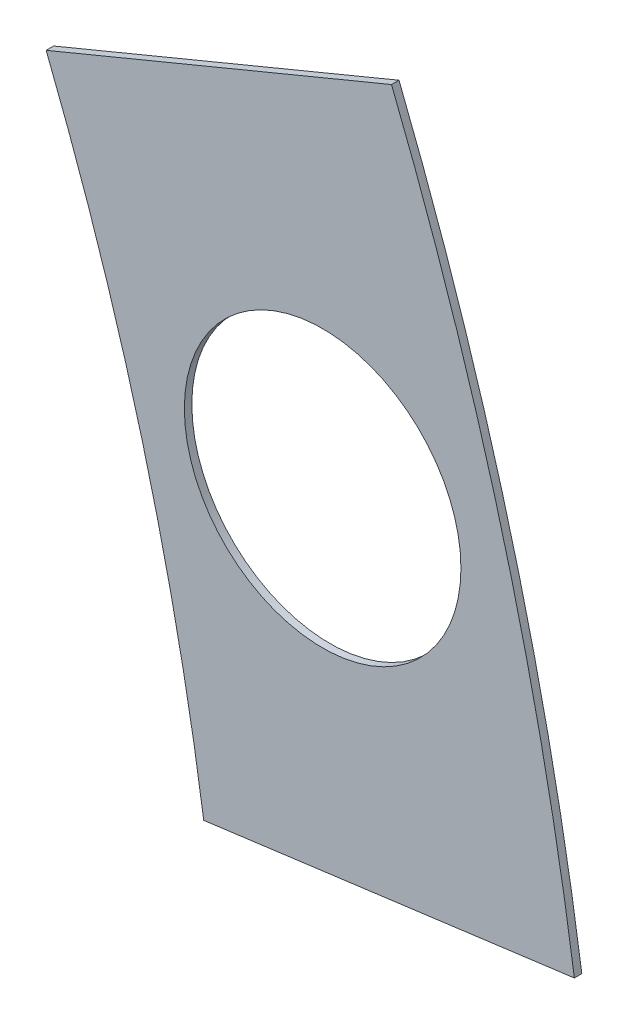
ISO-10303-21;
HEADER;
FILE_DESCRIPTION(('STEP AP214'),'2;1');
FILE_NAME('part.step','',(''),(''),'','','');
FILE_SCHEMA(('AUTOMOTIVE_DESIGN { 1 0 10303 214 1 1 1 1 }'));
ENDSEC;
DATA;
#1=APPLICATION_CONTEXT('core data for automotive mechanical design processes');
#2=APPLICATION_PROTOCOL_DEFINITION('international standard','automotive_design',2000,#1);
#3=PRODUCT_CONTEXT('',#1,'mechanical');
#4=PRODUCT('Part','Part','',(#3));
#5=PRODUCT_RELATED_PRODUCT_CATEGORY('part','',(#4));
#6=PRODUCT_DEFINITION_FORMATION('','',#4);
#7=PRODUCT_DEFINITION_CONTEXT('part definition',#1,'design');
#8=PRODUCT_DEFINITION('design','',#6,#7);
#9=PRODUCT_DEFINITION_SHAPE('','',#8);
#10=(LENGTH_UNIT() NAMED_UNIT(*) SI_UNIT(.MILLI.,.METRE.));
#11=(NAMED_UNIT(*) PLANE_ANGLE_UNIT() SI_UNIT($,.RADIAN.));
#12=(NAMED_UNIT(*) SI_UNIT($,.STERADIAN.) SOLID_ANGLE_UNIT());
#13=UNCERTAINTY_MEASURE_WITH_UNIT(LENGTH_MEASURE(1.E-05),#10,'distance_accuracy_value','');
#14=(GEOMETRIC_REPRESENTATION_CONTEXT(3) GLOBAL_UNCERTAINTY_ASSIGNED_CONTEXT((#13)) GLOBAL_UNIT_ASSIGNED_CONTEXT((#10,
#11,#12)) REPRESENTATION_CONTEXT('',''));
#15=CARTESIAN_POINT('',(0.,0.,0.));
#16=DIRECTION('',(0.,0.,1.));
#17=DIRECTION('',(1.,0.,0.));
#18=AXIS2_PLACEMENT_3D('',#15,#16,#17);
#19=CARTESIAN_POINT('',(0.,0.,0.254));
#20=DIRECTION('',(0.,0.,-1.));
#21=DIRECTION('',(-1.,0.,0.));
#22=AXIS2_PLACEMENT_3D('',#19,#20,#21);
#23=PLANE('',#22);
#24=CARTESIAN_POINT('',(92.0044349540337,24.6525140460152,0.254));
#25=DIRECTION('',(0.,0.,1.));
#26=DIRECTION('',(1.,0.,0.));
#27=AXIS2_PLACEMENT_3D('',#24,#25,#26);
#28=CIRCLE('',#27,4.69899999999999);
#29=CARTESIAN_POINT('',(96.7034349540337,24.6525140460152,0.254));
#30=VERTEX_POINT('',#29);
#31=EDGE_CURVE('E100',#30,#30,#28,.T.);
#32=ORIENTED_EDGE('',*,*,#31,.F.);
#33=EDGE_LOOP('',(#32));
#34=FACE_BOUND('',#33,.T.);
#35=DIRECTION('',(0.923879532511285,0.382683432365093,0.));
#36=VECTOR('',#35,1.);
#37=CARTESIAN_POINT('',(93.7655049591057,37.464305742452,0.254));
#38=LINE('',#37,#36);
#39=CARTESIAN_POINT('',(82.6105170645283,32.8437584684104,0.254));
#40=VERTEX_POINT('',#39);
#41=CARTESIAN_POINT('',(94.3448348819819,37.7042720535959,0.254));
#42=VERTEX_POINT('',#41);
#43=EDGE_CURVE('E75',#40,#42,#38,.T.);
#44=ORIENTED_EDGE('',*,*,#43,.F.);
#45=CARTESIAN_POINT('',(0.,0.,0.254));
#46=DIRECTION('',(0.,0.,1.));
#47=DIRECTION('',(-1.,0.,0.));
#48=AXIS2_PLACEMENT_3D('',#45,#46,#47);
#49=CIRCLE('',#48,88.9);
#50=CARTESIAN_POINT('',(87.9646856318545,12.8617293428609,0.254));
#51=VERTEX_POINT('',#50);
#52=EDGE_CURVE('E79',#51,#40,#49,.T.);
#53=ORIENTED_EDGE('',*,*,#52,.F.);
#54=DIRECTION('',(-0.991444861373813,-0.130526192220036,0.));
#55=VECTOR('',#54,1.);
#56=CARTESIAN_POINT('',(99.9354621644873,14.4377119714424,0.254));
#57=LINE('',#56,#55);
#58=CARTESIAN_POINT('',(100.557159750442,14.5195600113774,0.254));
#59=VERTEX_POINT('',#58);
#60=EDGE_CURVE('E106',#59,#51,#57,.T.);
#61=ORIENTED_EDGE('',*,*,#60,.F.);
#62=CARTESIAN_POINT('',(0.,0.,0.254));
#63=DIRECTION('',(0.,0.,1.));
#64=DIRECTION('',(-1.,0.,0.));
#65=AXIS2_PLACEMENT_3D('',#62,#63,#64);
#66=CIRCLE('',#65,101.6);
#67=EDGE_CURVE('E43',#59,#42,#66,.T.);
#68=ORIENTED_EDGE('',*,*,#67,.T.);
#69=EDGE_LOOP('',(#44,#53,#61,#68));
#70=FACE_BOUND('',#69,.T.);
#71=ADVANCED_FACE('F35',(#34,#70),#23,.F.);
#72=CARTESIAN_POINT('',(0.,0.,0.));
#73=DIRECTION('',(0.,0.,-1.));
#74=DIRECTION('',(-1.,0.,0.));
#75=AXIS2_PLACEMENT_3D('',#72,#73,#74);
#76=PLANE('',#75);
#77=CARTESIAN_POINT('',(92.0044349540337,24.6525140460152,0.));
#78=DIRECTION('',(0.,0.,1.));
#79=DIRECTION('',(1.,0.,0.));
#80=AXIS2_PLACEMENT_3D('',#77,#78,#79);
#81=CIRCLE('',#80,4.69899999999999);
#82=CARTESIAN_POINT('',(96.7034349540337,24.6525140460152,0.));
#83=VERTEX_POINT('',#82);
#84=EDGE_CURVE('E97',#83,#83,#81,.T.);
#85=ORIENTED_EDGE('',*,*,#84,.T.);
#86=EDGE_LOOP('',(#85));
#87=FACE_BOUND('',#86,.T.);
#88=CARTESIAN_POINT('',(0.,0.,0.));
#89=DIRECTION('',(0.,0.,1.));
#90=DIRECTION('',(-1.,0.,0.));
#91=AXIS2_PLACEMENT_3D('',#88,#89,#90);
#92=CIRCLE('',#91,88.9);
#93=CARTESIAN_POINT('',(87.9646856318545,12.8617293428609,0.));
#94=VERTEX_POINT('',#93);
#95=CARTESIAN_POINT('',(82.6105170645283,32.8437584684104,0.));
#96=VERTEX_POINT('',#95);
#97=EDGE_CURVE('E94',#94,#96,#92,.T.);
#98=ORIENTED_EDGE('',*,*,#97,.T.);
#99=DIRECTION('',(0.923879532511285,0.382683432365093,0.));
#100=VECTOR('',#99,1.);
#101=CARTESIAN_POINT('',(93.7655049591057,37.464305742452,0.));
#102=LINE('',#101,#100);
#103=CARTESIAN_POINT('',(94.3448348819819,37.7042720535959,0.));
#104=VERTEX_POINT('',#103);
#105=EDGE_CURVE('E81',#96,#104,#102,.T.);
#106=ORIENTED_EDGE('',*,*,#105,.T.);
#107=CARTESIAN_POINT('',(0.,0.,0.));
#108=DIRECTION('',(0.,0.,1.));
#109=DIRECTION('',(-1.,0.,0.));
#110=AXIS2_PLACEMENT_3D('',#107,#108,#109);
#111=CIRCLE('',#110,101.6);
#112=CARTESIAN_POINT('',(100.557159750442,14.5195600113774,0.));
#113=VERTEX_POINT('',#112);
#114=EDGE_CURVE('E93',#113,#104,#111,.T.);
#115=ORIENTED_EDGE('',*,*,#114,.F.);
#116=DIRECTION('',(-0.991444861373813,-0.130526192220036,0.));
#117=VECTOR('',#116,1.);
#118=CARTESIAN_POINT('',(99.9354621644873,14.4377119714424,0.));
#119=LINE('',#118,#117);
#120=EDGE_CURVE('E58',#113,#94,#119,.T.);
#121=ORIENTED_EDGE('',*,*,#120,.T.);
#122=EDGE_LOOP('',(#98,#106,#115,#121));
#123=FACE_BOUND('',#122,.T.);
#124=ADVANCED_FACE('F113',(#87,#123),#76,.T.);
#125=CARTESIAN_POINT('',(0.,0.,0.254));
#126=DIRECTION('',(0.,0.,-1.));
#127=DIRECTION('',(-1.,0.,0.));
#128=AXIS2_PLACEMENT_3D('',#125,#126,#127);
#129=CYLINDRICAL_SURFACE('',#128,88.9);
#130=ORIENTED_EDGE('',*,*,#52,.T.);
#131=DIRECTION('',(0.,0.,-1.));
#132=VECTOR('',#131,1.);
#133=CARTESIAN_POINT('',(82.6105170645283,32.8437584684104,0.254));
#134=LINE('',#133,#132);
#135=EDGE_CURVE('E85',#40,#96,#134,.T.);
#136=ORIENTED_EDGE('',*,*,#135,.T.);
#137=ORIENTED_EDGE('',*,*,#97,.F.);
#138=DIRECTION('',(0.,0.,-1.));
#139=VECTOR('',#138,1.);
#140=CARTESIAN_POINT('',(87.9646856318545,12.8617293428609,0.254));
#141=LINE('',#140,#139);
#142=EDGE_CURVE('E82',#94,#51,#141,.F.);
#143=ORIENTED_EDGE('',*,*,#142,.T.);
#144=EDGE_LOOP('',(#130,#136,#137,#143));
#145=FACE_BOUND('',#144,.T.);
#146=ADVANCED_FACE('F92',(#145),#129,.F.);
#147=CARTESIAN_POINT('',(0.,0.,0.254));
#148=DIRECTION('',(0.,0.,-1.));
#149=DIRECTION('',(-1.,0.,0.));
#150=AXIS2_PLACEMENT_3D('',#147,#148,#149);
#151=CYLINDRICAL_SURFACE('',#150,101.6);
#152=ORIENTED_EDGE('',*,*,#114,.T.);
#153=DIRECTION('',(0.,0.,-1.));
#154=VECTOR('',#153,1.);
#155=CARTESIAN_POINT('',(94.3448348819819,37.7042720535959,0.254));
#156=LINE('',#155,#154);
#157=EDGE_CURVE('E50',#104,#42,#156,.F.);
#158=ORIENTED_EDGE('',*,*,#157,.T.);
#159=ORIENTED_EDGE('',*,*,#67,.F.);
#160=DIRECTION('',(0.,0.,-1.));
#161=VECTOR('',#160,1.);
#162=CARTESIAN_POINT('',(100.557159750442,14.5195600113774,0.254));
#163=LINE('',#162,#161);
#164=EDGE_CURVE('E12',#59,#113,#163,.T.);
#165=ORIENTED_EDGE('',*,*,#164,.T.);
#166=EDGE_LOOP('',(#152,#158,#159,#165));
#167=FACE_BOUND('',#166,.T.);
#168=ADVANCED_FACE('F37',(#167),#151,.T.);
#169=CARTESIAN_POINT('',(92.0044349540337,24.6525140460152,0.));
#170=DIRECTION('',(0.,0.,1.));
#171=DIRECTION('',(1.,0.,0.));
#172=AXIS2_PLACEMENT_3D('',#169,#170,#171);
#173=CYLINDRICAL_SURFACE('',#172,4.69899999999999);
#174=ORIENTED_EDGE('',*,*,#84,.F.);
#175=EDGE_LOOP('',(#174));
#176=FACE_BOUND('',#175,.T.);
#177=ORIENTED_EDGE('',*,*,#31,.T.);
#178=EDGE_LOOP('',(#177));
#179=FACE_BOUND('',#178,.T.);
#180=ADVANCED_FACE('F117',(#176,#179),#173,.F.);
#181=CARTESIAN_POINT('',(99.9354621644873,14.4377119714424,0.));
#182=DIRECTION('',(-0.130526192220036,0.991444861373813,0.));
#183=DIRECTION('',(-0.991444861373813,-0.130526192220036,0.));
#184=AXIS2_PLACEMENT_3D('',#181,#182,#183);
#185=PLANE('',#184);
#186=ORIENTED_EDGE('',*,*,#60,.T.);
#187=ORIENTED_EDGE('',*,*,#142,.F.);
#188=ORIENTED_EDGE('',*,*,#120,.F.);
#189=ORIENTED_EDGE('',*,*,#164,.F.);
#190=EDGE_LOOP('',(#186,#187,#188,#189));
#191=FACE_BOUND('',#190,.T.);
#192=ADVANCED_FACE('F115',(#191),#185,.F.);
#193=CARTESIAN_POINT('',(93.7655049591057,37.464305742452,0.));
#194=DIRECTION('',(0.382683432365093,-0.923879532511285,0.));
#195=DIRECTION('',(0.923879532511285,0.382683432365093,0.));
#196=AXIS2_PLACEMENT_3D('',#193,#194,#195);
#197=PLANE('',#196);
#198=ORIENTED_EDGE('',*,*,#105,.F.);
#199=ORIENTED_EDGE('',*,*,#135,.F.);
#200=ORIENTED_EDGE('',*,*,#43,.T.);
#201=ORIENTED_EDGE('',*,*,#157,.F.);
#202=EDGE_LOOP('',(#198,#199,#200,#201));
#203=FACE_BOUND('',#202,.T.);
#204=ADVANCED_FACE('F86',(#203),#197,.F.);
#205=CLOSED_SHELL('',(#71,#124,#146,#168,#180,#192,#204));
#206=MANIFOLD_SOLID_BREP('B2',#205);
#207=ADVANCED_BREP_SHAPE_REPRESENTATION('',(#18,#206),#14);
#208=SHAPE_DEFINITION_REPRESENTATION(#9,#207);
ENDSEC;
END-ISO-10303-21;
